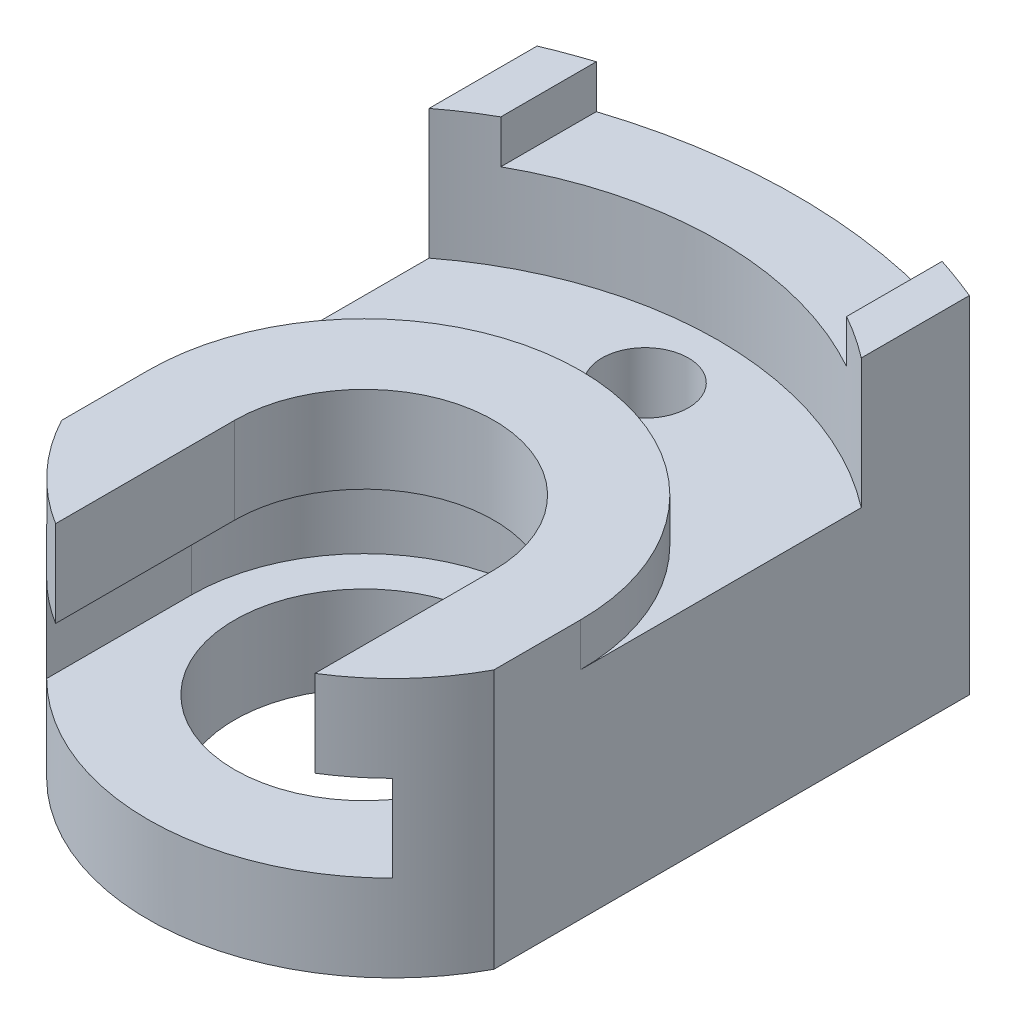
ISO-10303-21;
HEADER;
FILE_DESCRIPTION(('STEP AP214'),'2;1');
FILE_NAME('part.step','',(''),(''),'','','');
FILE_SCHEMA(('AUTOMOTIVE_DESIGN { 1 0 10303 214 1 1 1 1 }'));
ENDSEC;
DATA;
#1=APPLICATION_CONTEXT('core data for automotive mechanical design processes');
#2=APPLICATION_PROTOCOL_DEFINITION('international standard','automotive_design',2000,#1);
#3=PRODUCT_CONTEXT('',#1,'mechanical');
#4=PRODUCT('Part','Part','',(#3));
#5=PRODUCT_RELATED_PRODUCT_CATEGORY('part','',(#4));
#6=PRODUCT_DEFINITION_FORMATION('','',#4);
#7=PRODUCT_DEFINITION_CONTEXT('part definition',#1,'design');
#8=PRODUCT_DEFINITION('design','',#6,#7);
#9=PRODUCT_DEFINITION_SHAPE('','',#8);
#10=(LENGTH_UNIT() NAMED_UNIT(*) SI_UNIT(.MILLI.,.METRE.));
#11=(NAMED_UNIT(*) PLANE_ANGLE_UNIT() SI_UNIT($,.RADIAN.));
#12=(NAMED_UNIT(*) SI_UNIT($,.STERADIAN.) SOLID_ANGLE_UNIT());
#13=UNCERTAINTY_MEASURE_WITH_UNIT(LENGTH_MEASURE(1.E-05),#10,'distance_accuracy_value','');
#14=(GEOMETRIC_REPRESENTATION_CONTEXT(3) GLOBAL_UNCERTAINTY_ASSIGNED_CONTEXT((#13)) GLOBAL_UNIT_ASSIGNED_CONTEXT((#10,
#11,#12)) REPRESENTATION_CONTEXT('',''));
#15=CARTESIAN_POINT('',(0.,0.,0.));
#16=DIRECTION('',(0.,0.,1.));
#17=DIRECTION('',(1.,0.,0.));
#18=AXIS2_PLACEMENT_3D('',#15,#16,#17);
#19=CARTESIAN_POINT('',(0.,-11.,-4.));
#20=DIRECTION('',(0.,1.,0.));
#21=DIRECTION('',(0.,0.,1.));
#22=AXIS2_PLACEMENT_3D('',#19,#20,#21);
#23=CYLINDRICAL_SURFACE('',#22,0.5);
#24=CARTESIAN_POINT('',(0.,-4.,-4.));
#25=DIRECTION('',(0.,1.,0.));
#26=DIRECTION('',(0.,0.,1.));
#27=AXIS2_PLACEMENT_3D('',#24,#25,#26);
#28=CIRCLE('',#27,0.5);
#29=CARTESIAN_POINT('',(0.,-4.,-3.5));
#30=VERTEX_POINT('',#29);
#31=EDGE_CURVE('E345',#30,#30,#28,.T.);
#32=ORIENTED_EDGE('',*,*,#31,.F.);
#33=EDGE_LOOP('',(#32));
#34=FACE_BOUND('',#33,.T.);
#35=CARTESIAN_POINT('',(0.,-0.999999999999999,-4.));
#36=DIRECTION('',(0.,1.,0.));
#37=DIRECTION('',(0.,0.,1.));
#38=AXIS2_PLACEMENT_3D('',#35,#36,#37);
#39=CIRCLE('',#38,0.5);
#40=CARTESIAN_POINT('',(0.,-0.999999999999999,-3.5));
#41=VERTEX_POINT('',#40);
#42=EDGE_CURVE('E99',#41,#41,#39,.F.);
#43=ORIENTED_EDGE('',*,*,#42,.F.);
#44=EDGE_LOOP('',(#43));
#45=FACE_BOUND('',#44,.T.);
#46=ADVANCED_FACE('F95',(#34,#45),#23,.F.);
#47=CARTESIAN_POINT('',(5.,0.,7.5));
#48=DIRECTION('',(-1.,0.,0.));
#49=DIRECTION('',(0.,0.,1.));
#50=AXIS2_PLACEMENT_3D('',#47,#48,#49);
#51=PLANE('',#50);
#52=DIRECTION('',(0.,1.,0.));
#53=VECTOR('',#52,1.);
#54=CARTESIAN_POINT('',(5.,1.,2.5));
#55=LINE('',#54,#53);
#56=CARTESIAN_POINT('',(5.,1.,2.5));
#57=VERTEX_POINT('',#56);
#58=CARTESIAN_POINT('',(5.,2.,2.5));
#59=VERTEX_POINT('',#58);
#60=EDGE_CURVE('E232',#57,#59,#55,.T.);
#61=ORIENTED_EDGE('',*,*,#60,.T.);
#62=DIRECTION('',(0.,0.,-1.));
#63=VECTOR('',#62,1.);
#64=CARTESIAN_POINT('',(5.,2.,2.5));
#65=LINE('',#64,#63);
#66=CARTESIAN_POINT('',(5.,2.,4.5));
#67=VERTEX_POINT('',#66);
#68=EDGE_CURVE('E279',#67,#59,#65,.T.);
#69=ORIENTED_EDGE('',*,*,#68,.F.);
#70=DIRECTION('',(0.,1.,0.));
#71=VECTOR('',#70,1.);
#72=CARTESIAN_POINT('',(5.,-11.,4.5));
#73=LINE('',#72,#71);
#74=CARTESIAN_POINT('',(5.,-4.,4.5));
#75=VERTEX_POINT('',#74);
#76=EDGE_CURVE('E333',#75,#67,#73,.T.);
#77=ORIENTED_EDGE('',*,*,#76,.F.);
#78=DIRECTION('',(0.,0.,-1.));
#79=VECTOR('',#78,1.);
#80=CARTESIAN_POINT('',(5.,-4.,7.5));
#81=LINE('',#80,#79);
#82=CARTESIAN_POINT('',(5.,-4.,-6.5));
#83=VERTEX_POINT('',#82);
#84=EDGE_CURVE('E369',#75,#83,#81,.T.);
#85=ORIENTED_EDGE('',*,*,#84,.T.);
#86=DIRECTION('',(0.,1.,0.));
#87=VECTOR('',#86,1.);
#88=CARTESIAN_POINT('',(5.,-11.,-6.5));
#89=LINE('',#88,#87);
#90=CARTESIAN_POINT('',(5.,4.,-6.5));
#91=VERTEX_POINT('',#90);
#92=EDGE_CURVE('E349',#83,#91,#89,.T.);
#93=ORIENTED_EDGE('',*,*,#92,.T.);
#94=DIRECTION('',(0.,0.,-1.));
#95=VECTOR('',#94,1.);
#96=CARTESIAN_POINT('',(5.,4.,7.5));
#97=LINE('',#96,#95);
#98=CARTESIAN_POINT('',(5.,4.,-4.));
#99=VERTEX_POINT('',#98);
#100=EDGE_CURVE('E367',#99,#91,#97,.T.);
#101=ORIENTED_EDGE('',*,*,#100,.F.);
#102=DIRECTION('',(0.,1.,0.));
#103=VECTOR('',#102,1.);
#104=CARTESIAN_POINT('',(5.,1.,-4.));
#105=LINE('',#104,#103);
#106=CARTESIAN_POINT('',(5.,1.,-4.));
#107=VERTEX_POINT('',#106);
#108=EDGE_CURVE('E243',#107,#99,#105,.T.);
#109=ORIENTED_EDGE('',*,*,#108,.F.);
#110=DIRECTION('',(0.,0.,-1.));
#111=VECTOR('',#110,1.);
#112=CARTESIAN_POINT('',(5.,1.,2.5));
#113=LINE('',#112,#111);
#114=EDGE_CURVE('E250',#57,#107,#113,.T.);
#115=ORIENTED_EDGE('',*,*,#114,.F.);
#116=EDGE_LOOP('',(#61,#69,#77,#85,#93,#101,#109,#115));
#117=FACE_BOUND('',#116,.T.);
#118=ADVANCED_FACE('F256',(#117),#51,.F.);
#119=CARTESIAN_POINT('',(-5.,0.,7.5));
#120=DIRECTION('',(-1.,0.,0.));
#121=DIRECTION('',(0.,0.,1.));
#122=AXIS2_PLACEMENT_3D('',#119,#120,#121);
#123=PLANE('',#122);
#124=DIRECTION('',(0.,0.,1.));
#125=VECTOR('',#124,1.);
#126=CARTESIAN_POINT('',(-5.,2.,2.5));
#127=LINE('',#126,#125);
#128=CARTESIAN_POINT('',(-5.,2.,2.5));
#129=VERTEX_POINT('',#128);
#130=CARTESIAN_POINT('',(-5.,2.,4.49999999999999));
#131=VERTEX_POINT('',#130);
#132=EDGE_CURVE('E277',#129,#131,#127,.T.);
#133=ORIENTED_EDGE('',*,*,#132,.F.);
#134=DIRECTION('',(0.,1.,0.));
#135=VECTOR('',#134,1.);
#136=CARTESIAN_POINT('',(-5.,1.,2.5));
#137=LINE('',#136,#135);
#138=CARTESIAN_POINT('',(-5.,1.,2.5));
#139=VERTEX_POINT('',#138);
#140=EDGE_CURVE('E266',#139,#129,#137,.T.);
#141=ORIENTED_EDGE('',*,*,#140,.F.);
#142=DIRECTION('',(0.,0.,1.));
#143=VECTOR('',#142,1.);
#144=CARTESIAN_POINT('',(-5.,1.,2.5));
#145=LINE('',#144,#143);
#146=CARTESIAN_POINT('',(-5.,1.,-4.));
#147=VERTEX_POINT('',#146);
#148=EDGE_CURVE('E244',#147,#139,#145,.T.);
#149=ORIENTED_EDGE('',*,*,#148,.F.);
#150=DIRECTION('',(0.,1.,0.));
#151=VECTOR('',#150,1.);
#152=CARTESIAN_POINT('',(-5.,1.,-4.));
#153=LINE('',#152,#151);
#154=CARTESIAN_POINT('',(-5.,4.,-4.));
#155=VERTEX_POINT('',#154);
#156=EDGE_CURVE('E269',#147,#155,#153,.T.);
#157=ORIENTED_EDGE('',*,*,#156,.T.);
#158=DIRECTION('',(0.,0.,-1.));
#159=VECTOR('',#158,1.);
#160=CARTESIAN_POINT('',(-5.,4.,7.5));
#161=LINE('',#160,#159);
#162=CARTESIAN_POINT('',(-5.,4.,-6.5));
#163=VERTEX_POINT('',#162);
#164=EDGE_CURVE('E374',#155,#163,#161,.T.);
#165=ORIENTED_EDGE('',*,*,#164,.T.);
#166=DIRECTION('',(0.,1.,0.));
#167=VECTOR('',#166,1.);
#168=CARTESIAN_POINT('',(-5.,-11.,-6.5));
#169=LINE('',#168,#167);
#170=CARTESIAN_POINT('',(-5.,-4.,-6.5));
#171=VERTEX_POINT('',#170);
#172=EDGE_CURVE('E334',#171,#163,#169,.T.);
#173=ORIENTED_EDGE('',*,*,#172,.F.);
#174=DIRECTION('',(0.,0.,-1.));
#175=VECTOR('',#174,1.);
#176=CARTESIAN_POINT('',(-5.,-4.,7.5));
#177=LINE('',#176,#175);
#178=CARTESIAN_POINT('',(-5.,-4.,4.5));
#179=VERTEX_POINT('',#178);
#180=EDGE_CURVE('E371',#179,#171,#177,.T.);
#181=ORIENTED_EDGE('',*,*,#180,.F.);
#182=DIRECTION('',(0.,1.,0.));
#183=VECTOR('',#182,1.);
#184=CARTESIAN_POINT('',(-5.,-11.,4.5));
#185=LINE('',#184,#183);
#186=EDGE_CURVE('E118',#179,#131,#185,.T.);
#187=ORIENTED_EDGE('',*,*,#186,.T.);
#188=EDGE_LOOP('',(#133,#141,#149,#157,#165,#173,#181,#187));
#189=FACE_BOUND('',#188,.T.);
#190=ADVANCED_FACE('F439',(#189),#123,.T.);
#191=CARTESIAN_POINT('',(0.,-11.,2.5));
#192=DIRECTION('',(0.,1.,0.));
#193=DIRECTION('',(0.,0.,1.));
#194=AXIS2_PLACEMENT_3D('',#191,#192,#193);
#195=CYLINDRICAL_SURFACE('',#194,3.);
#196=CARTESIAN_POINT('',(0.,2.,2.5));
#197=DIRECTION('',(0.,1.,0.));
#198=DIRECTION('',(0.,0.,1.));
#199=AXIS2_PLACEMENT_3D('',#196,#197,#198);
#200=CIRCLE('',#199,3.);
#201=CARTESIAN_POINT('',(-3.,2.,2.5));
#202=VERTEX_POINT('',#201);
#203=CARTESIAN_POINT('',(3.,2.,2.5));
#204=VERTEX_POINT('',#203);
#205=EDGE_CURVE('E282',#202,#204,#200,.F.);
#206=ORIENTED_EDGE('',*,*,#205,.F.);
#207=DIRECTION('',(0.,1.,0.));
#208=VECTOR('',#207,1.);
#209=CARTESIAN_POINT('',(-3.,0.,2.5));
#210=LINE('',#209,#208);
#211=CARTESIAN_POINT('',(-3.,0.,2.5));
#212=VERTEX_POINT('',#211);
#213=EDGE_CURVE('E322',#212,#202,#210,.T.);
#214=ORIENTED_EDGE('',*,*,#213,.F.);
#215=CARTESIAN_POINT('',(0.,0.,2.5));
#216=DIRECTION('',(0.,1.,0.));
#217=DIRECTION('',(0.,0.,1.));
#218=AXIS2_PLACEMENT_3D('',#215,#216,#217);
#219=CIRCLE('',#218,3.);
#220=CARTESIAN_POINT('',(3.,0.,2.5));
#221=VERTEX_POINT('',#220);
#222=EDGE_CURVE('E312',#212,#221,#219,.F.);
#223=ORIENTED_EDGE('',*,*,#222,.T.);
#224=DIRECTION('',(0.,1.,0.));
#225=VECTOR('',#224,1.);
#226=CARTESIAN_POINT('',(3.,0.,2.5));
#227=LINE('',#226,#225);
#228=EDGE_CURVE('E323',#221,#204,#227,.T.);
#229=ORIENTED_EDGE('',*,*,#228,.T.);
#230=EDGE_LOOP('',(#206,#214,#223,#229));
#231=FACE_BOUND('',#230,.T.);
#232=ADVANCED_FACE('F400',(#231),#195,.F.);
#233=CARTESIAN_POINT('',(0.,-11.,1.83333333333333));
#234=DIRECTION('',(0.,1.,0.));
#235=DIRECTION('',(0.,0.,1.));
#236=AXIS2_PLACEMENT_3D('',#233,#234,#235);
#237=CYLINDRICAL_SURFACE('',#236,5.66666666666667);
#238=DIRECTION('',(0.,1.,0.));
#239=VECTOR('',#238,1.);
#240=CARTESIAN_POINT('',(-3.,-11.,6.64073503395198));
#241=LINE('',#240,#239);
#242=CARTESIAN_POINT('',(-3.,2.,6.64073503395198));
#243=VERTEX_POINT('',#242);
#244=CARTESIAN_POINT('',(-3.,0.,6.64073503395198));
#245=VERTEX_POINT('',#244);
#246=EDGE_CURVE('E326',#243,#245,#241,.F.);
#247=ORIENTED_EDGE('',*,*,#246,.F.);
#248=CARTESIAN_POINT('',(0.,2.,1.83333333333333));
#249=DIRECTION('',(0.,1.,0.));
#250=DIRECTION('',(0.,0.,1.));
#251=AXIS2_PLACEMENT_3D('',#248,#249,#250);
#252=CIRCLE('',#251,5.66666666666667);
#253=EDGE_CURVE('E111',#243,#131,#252,.F.);
#254=ORIENTED_EDGE('',*,*,#253,.T.);
#255=ORIENTED_EDGE('',*,*,#186,.F.);
#256=CARTESIAN_POINT('',(0.,-4.,1.83333333333333));
#257=DIRECTION('',(0.,1.,0.));
#258=DIRECTION('',(0.,0.,1.));
#259=AXIS2_PLACEMENT_3D('',#256,#257,#258);
#260=CIRCLE('',#259,5.66666666666667);
#261=EDGE_CURVE('E362',#179,#75,#260,.T.);
#262=ORIENTED_EDGE('',*,*,#261,.T.);
#263=ORIENTED_EDGE('',*,*,#76,.T.);
#264=CARTESIAN_POINT('',(3.,2.,6.64073503395199));
#265=VERTEX_POINT('',#264);
#266=EDGE_CURVE('E283',#67,#265,#252,.F.);
#267=ORIENTED_EDGE('',*,*,#266,.T.);
#268=DIRECTION('',(0.,1.,0.));
#269=VECTOR('',#268,1.);
#270=CARTESIAN_POINT('',(3.,-11.,6.64073503395199));
#271=LINE('',#270,#269);
#272=CARTESIAN_POINT('',(3.,0.,6.64073503395198));
#273=VERTEX_POINT('',#272);
#274=EDGE_CURVE('E330',#273,#265,#271,.T.);
#275=ORIENTED_EDGE('',*,*,#274,.F.);
#276=CARTESIAN_POINT('',(0.,0.,1.83333333333333));
#277=DIRECTION('',(0.,1.,0.));
#278=DIRECTION('',(0.,0.,1.));
#279=AXIS2_PLACEMENT_3D('',#276,#277,#278);
#280=CIRCLE('',#279,5.66666666666667);
#281=CARTESIAN_POINT('',(4.,0.,5.84719819293076));
#282=VERTEX_POINT('',#281);
#283=EDGE_CURVE('E307',#282,#273,#280,.F.);
#284=ORIENTED_EDGE('',*,*,#283,.F.);
#285=DIRECTION('',(0.,1.,0.));
#286=VECTOR('',#285,1.);
#287=CARTESIAN_POINT('',(4.,-11.,5.84719819293076));
#288=LINE('',#287,#286);
#289=CARTESIAN_POINT('',(4.,-2.,5.84719819293076));
#290=VERTEX_POINT('',#289);
#291=EDGE_CURVE('E382',#290,#282,#288,.T.);
#292=ORIENTED_EDGE('',*,*,#291,.F.);
#293=CARTESIAN_POINT('',(0.,-2.,1.83333333333333));
#294=DIRECTION('',(0.,1.,0.));
#295=DIRECTION('',(0.,0.,1.));
#296=AXIS2_PLACEMENT_3D('',#293,#294,#295);
#297=CIRCLE('',#296,5.66666666666667);
#298=CARTESIAN_POINT('',(-4.,-2.,5.84719819293076));
#299=VERTEX_POINT('',#298);
#300=EDGE_CURVE('E388',#290,#299,#297,.F.);
#301=ORIENTED_EDGE('',*,*,#300,.T.);
#302=DIRECTION('',(0.,1.,0.));
#303=VECTOR('',#302,1.);
#304=CARTESIAN_POINT('',(-4.,-11.,5.84719819293076));
#305=LINE('',#304,#303);
#306=CARTESIAN_POINT('',(-4.,0.,5.84719819293076));
#307=VERTEX_POINT('',#306);
#308=EDGE_CURVE('E391',#307,#299,#305,.F.);
#309=ORIENTED_EDGE('',*,*,#308,.F.);
#310=EDGE_CURVE('E309',#245,#307,#280,.F.);
#311=ORIENTED_EDGE('',*,*,#310,.F.);
#312=EDGE_LOOP('',(#247,#254,#255,#262,#263,#267,#275,#284,#292,#301,#309,#311));
#313=FACE_BOUND('',#312,.T.);
#314=ADVANCED_FACE('F409',(#313),#237,.T.);
#315=CARTESIAN_POINT('',(3.,0.,2.5));
#316=DIRECTION('',(1.,0.,0.));
#317=DIRECTION('',(0.,0.,-1.));
#318=AXIS2_PLACEMENT_3D('',#315,#316,#317);
#319=PLANE('',#318);
#320=DIRECTION('',(0.,0.,1.));
#321=VECTOR('',#320,1.);
#322=CARTESIAN_POINT('',(3.,2.,2.5));
#323=LINE('',#322,#321);
#324=EDGE_CURVE('E285',#204,#265,#323,.T.);
#325=ORIENTED_EDGE('',*,*,#324,.F.);
#326=ORIENTED_EDGE('',*,*,#228,.F.);
#327=DIRECTION('',(0.,0.,-1.));
#328=VECTOR('',#327,1.);
#329=CARTESIAN_POINT('',(3.,0.,2.5));
#330=LINE('',#329,#328);
#331=EDGE_CURVE('E320',#273,#221,#330,.T.);
#332=ORIENTED_EDGE('',*,*,#331,.F.);
#333=ORIENTED_EDGE('',*,*,#274,.T.);
#334=EDGE_LOOP('',(#325,#326,#332,#333));
#335=FACE_BOUND('',#334,.T.);
#336=ADVANCED_FACE('F430',(#335),#319,.F.);
#337=CARTESIAN_POINT('',(-3.,0.,2.5));
#338=DIRECTION('',(-1.,0.,0.));
#339=DIRECTION('',(0.,0.,1.));
#340=AXIS2_PLACEMENT_3D('',#337,#338,#339);
#341=PLANE('',#340);
#342=DIRECTION('',(0.,0.,-1.));
#343=VECTOR('',#342,1.);
#344=CARTESIAN_POINT('',(-3.,2.,2.5));
#345=LINE('',#344,#343);
#346=EDGE_CURVE('E104',#243,#202,#345,.T.);
#347=ORIENTED_EDGE('',*,*,#346,.F.);
#348=ORIENTED_EDGE('',*,*,#246,.T.);
#349=DIRECTION('',(0.,0.,1.));
#350=VECTOR('',#349,1.);
#351=CARTESIAN_POINT('',(-3.,0.,2.5));
#352=LINE('',#351,#350);
#353=EDGE_CURVE('E317',#212,#245,#352,.T.);
#354=ORIENTED_EDGE('',*,*,#353,.F.);
#355=ORIENTED_EDGE('',*,*,#213,.T.);
#356=EDGE_LOOP('',(#347,#348,#354,#355));
#357=FACE_BOUND('',#356,.T.);
#358=ADVANCED_FACE('F403',(#357),#341,.F.);
#359=CARTESIAN_POINT('',(0.,-4.,2.5));
#360=DIRECTION('',(0.,1.,0.));
#361=DIRECTION('',(0.,0.,1.));
#362=AXIS2_PLACEMENT_3D('',#359,#360,#361);
#363=CIRCLE('',#362,3.);
#364=CARTESIAN_POINT('',(0.,-4.,5.5));
#365=VERTEX_POINT('',#364);
#366=EDGE_CURVE('E364',#365,#365,#363,.T.);
#367=ORIENTED_EDGE('',*,*,#366,.F.);
#368=EDGE_LOOP('',(#367));
#369=FACE_BOUND('',#368,.T.);
#370=CARTESIAN_POINT('',(0.,-2.,2.5));
#371=DIRECTION('',(0.,1.,0.));
#372=DIRECTION('',(0.,0.,1.));
#373=AXIS2_PLACEMENT_3D('',#370,#371,#372);
#374=CIRCLE('',#373,3.);
#375=CARTESIAN_POINT('',(0.,-2.,5.5));
#376=VERTEX_POINT('',#375);
#377=EDGE_CURVE('E311',#376,#376,#374,.F.);
#378=ORIENTED_EDGE('',*,*,#377,.F.);
#379=EDGE_LOOP('',(#378));
#380=FACE_BOUND('',#379,.T.);
#381=ADVANCED_FACE('F507',(#369,#380),#195,.F.);
#382=CARTESIAN_POINT('',(0.,3.,7.5));
#383=DIRECTION('',(0.,1.,0.));
#384=DIRECTION('',(0.,0.,1.));
#385=AXIS2_PLACEMENT_3D('',#382,#383,#384);
#386=PLANE('',#385);
#387=CARTESIAN_POINT('',(0.,3.,2.5));
#388=DIRECTION('',(0.,1.,0.));
#389=DIRECTION('',(0.,0.,1.));
#390=AXIS2_PLACEMENT_3D('',#387,#388,#389);
#391=CIRCLE('',#390,8.20060973342836);
#392=CARTESIAN_POINT('',(4.,3.,-4.65891053163817));
#393=VERTEX_POINT('',#392);
#394=CARTESIAN_POINT('',(-4.,3.,-4.65891053163817));
#395=VERTEX_POINT('',#394);
#396=EDGE_CURVE('E268',#393,#395,#391,.T.);
#397=ORIENTED_EDGE('',*,*,#396,.F.);
#398=DIRECTION('',(0.,0.,-1.));
#399=VECTOR('',#398,1.);
#400=CARTESIAN_POINT('',(4.,3.,7.5));
#401=LINE('',#400,#399);
#402=CARTESIAN_POINT('',(4.,3.,-6.86931687685298));
#403=VERTEX_POINT('',#402);
#404=EDGE_CURVE('E380',#393,#403,#401,.T.);
#405=ORIENTED_EDGE('',*,*,#404,.T.);
#406=CARTESIAN_POINT('',(0.,3.,5.5));
#407=DIRECTION('',(0.,1.,0.));
#408=DIRECTION('',(0.,0.,1.));
#409=AXIS2_PLACEMENT_3D('',#406,#407,#408);
#410=CIRCLE('',#409,13.);
#411=CARTESIAN_POINT('',(-4.,3.,-6.86931687685298));
#412=VERTEX_POINT('',#411);
#413=EDGE_CURVE('E356',#412,#403,#410,.F.);
#414=ORIENTED_EDGE('',*,*,#413,.F.);
#415=DIRECTION('',(0.,0.,-1.));
#416=VECTOR('',#415,1.);
#417=CARTESIAN_POINT('',(-4.,3.,7.5));
#418=LINE('',#417,#416);
#419=EDGE_CURVE('E378',#395,#412,#418,.T.);
#420=ORIENTED_EDGE('',*,*,#419,.F.);
#421=EDGE_LOOP('',(#397,#405,#414,#420));
#422=FACE_BOUND('',#421,.T.);
#423=ADVANCED_FACE('F511',(#422),#386,.T.);
#424=CARTESIAN_POINT('',(0.,4.,7.5));
#425=DIRECTION('',(0.,1.,0.));
#426=DIRECTION('',(0.,0.,1.));
#427=AXIS2_PLACEMENT_3D('',#424,#425,#426);
#428=PLANE('',#427);
#429=CARTESIAN_POINT('',(0.,4.,2.5));
#430=DIRECTION('',(0.,1.,0.));
#431=DIRECTION('',(0.,0.,-1.));
#432=AXIS2_PLACEMENT_3D('',#429,#430,#431);
#433=CIRCLE('',#432,8.20060973342836);
#434=CARTESIAN_POINT('',(-4.,4.,-4.65891053163817));
#435=VERTEX_POINT('',#434);
#436=EDGE_CURVE('E265',#435,#155,#433,.T.);
#437=ORIENTED_EDGE('',*,*,#436,.F.);
#438=DIRECTION('',(0.,0.,-1.));
#439=VECTOR('',#438,1.);
#440=CARTESIAN_POINT('',(-4.,4.,7.5));
#441=LINE('',#440,#439);
#442=CARTESIAN_POINT('',(-4.,4.,-6.86931687685298));
#443=VERTEX_POINT('',#442);
#444=EDGE_CURVE('E376',#435,#443,#441,.T.);
#445=ORIENTED_EDGE('',*,*,#444,.T.);
#446=CARTESIAN_POINT('',(0.,4.,5.5));
#447=DIRECTION('',(0.,1.,0.));
#448=DIRECTION('',(0.,0.,1.));
#449=AXIS2_PLACEMENT_3D('',#446,#447,#448);
#450=CIRCLE('',#449,13.);
#451=EDGE_CURVE('E337',#163,#443,#450,.F.);
#452=ORIENTED_EDGE('',*,*,#451,.F.);
#453=ORIENTED_EDGE('',*,*,#164,.F.);
#454=EDGE_LOOP('',(#437,#445,#452,#453));
#455=FACE_BOUND('',#454,.T.);
#456=ADVANCED_FACE('F448',(#455),#428,.T.);
#457=CARTESIAN_POINT('',(0.,-4.,7.5));
#458=DIRECTION('',(0.,1.,0.));
#459=DIRECTION('',(0.,0.,1.));
#460=AXIS2_PLACEMENT_3D('',#457,#458,#459);
#461=PLANE('',#460);
#462=ORIENTED_EDGE('',*,*,#31,.T.);
#463=EDGE_LOOP('',(#462));
#464=FACE_BOUND('',#463,.T.);
#465=ORIENTED_EDGE('',*,*,#366,.T.);
#466=EDGE_LOOP('',(#465));
#467=FACE_BOUND('',#466,.T.);
#468=ORIENTED_EDGE('',*,*,#180,.T.);
#469=CARTESIAN_POINT('',(0.,-4.,5.5));
#470=DIRECTION('',(0.,1.,0.));
#471=DIRECTION('',(0.,0.,1.));
#472=AXIS2_PLACEMENT_3D('',#469,#470,#471);
#473=CIRCLE('',#472,13.);
#474=EDGE_CURVE('E352',#171,#83,#473,.F.);
#475=ORIENTED_EDGE('',*,*,#474,.T.);
#476=ORIENTED_EDGE('',*,*,#84,.F.);
#477=ORIENTED_EDGE('',*,*,#261,.F.);
#478=EDGE_LOOP('',(#468,#475,#476,#477));
#479=FACE_BOUND('',#478,.T.);
#480=ADVANCED_FACE('F435',(#464,#467,#479),#461,.F.);
#481=CARTESIAN_POINT('',(4.,4.,-4.65891053163817));
#482=VERTEX_POINT('',#481);
#483=EDGE_CURVE('E254',#99,#482,#433,.T.);
#484=ORIENTED_EDGE('',*,*,#483,.F.);
#485=ORIENTED_EDGE('',*,*,#100,.T.);
#486=CARTESIAN_POINT('',(0.,4.,5.5));
#487=DIRECTION('',(0.,1.,0.));
#488=DIRECTION('',(0.,0.,1.));
#489=AXIS2_PLACEMENT_3D('',#486,#487,#488);
#490=CIRCLE('',#489,13.);
#491=CARTESIAN_POINT('',(4.,4.,-6.86931687685298));
#492=VERTEX_POINT('',#491);
#493=EDGE_CURVE('E346',#492,#91,#490,.F.);
#494=ORIENTED_EDGE('',*,*,#493,.F.);
#495=DIRECTION('',(0.,0.,-1.));
#496=VECTOR('',#495,1.);
#497=CARTESIAN_POINT('',(4.,4.,7.5));
#498=LINE('',#497,#496);
#499=EDGE_CURVE('E365',#482,#492,#498,.T.);
#500=ORIENTED_EDGE('',*,*,#499,.F.);
#501=EDGE_LOOP('',(#484,#485,#494,#500));
#502=FACE_BOUND('',#501,.T.);
#503=ADVANCED_FACE('F463',(#502),#428,.T.);
#504=CARTESIAN_POINT('',(4.,0.,7.5));
#505=DIRECTION('',(-1.,0.,0.));
#506=DIRECTION('',(0.,0.,1.));
#507=AXIS2_PLACEMENT_3D('',#504,#505,#506);
#508=PLANE('',#507);
#509=DIRECTION('',(0.,1.,0.));
#510=VECTOR('',#509,1.);
#511=CARTESIAN_POINT('',(4.,1.,-4.65891053163817));
#512=LINE('',#511,#510);
#513=EDGE_CURVE('E274',#482,#393,#512,.F.);
#514=ORIENTED_EDGE('',*,*,#513,.F.);
#515=ORIENTED_EDGE('',*,*,#499,.T.);
#516=DIRECTION('',(0.,1.,0.));
#517=VECTOR('',#516,1.);
#518=CARTESIAN_POINT('',(4.,-11.,-6.86931687685298));
#519=LINE('',#518,#517);
#520=EDGE_CURVE('E359',#403,#492,#519,.T.);
#521=ORIENTED_EDGE('',*,*,#520,.F.);
#522=ORIENTED_EDGE('',*,*,#404,.F.);
#523=EDGE_LOOP('',(#514,#515,#521,#522));
#524=FACE_BOUND('',#523,.T.);
#525=ADVANCED_FACE('F97',(#524),#508,.T.);
#526=CARTESIAN_POINT('',(-4.,0.,7.5));
#527=DIRECTION('',(-1.,0.,0.));
#528=DIRECTION('',(0.,0.,1.));
#529=AXIS2_PLACEMENT_3D('',#526,#527,#528);
#530=PLANE('',#529);
#531=ORIENTED_EDGE('',*,*,#444,.F.);
#532=DIRECTION('',(0.,1.,0.));
#533=VECTOR('',#532,1.);
#534=CARTESIAN_POINT('',(-4.,1.,-4.65891053163817));
#535=LINE('',#534,#533);
#536=EDGE_CURVE('E12',#435,#395,#535,.F.);
#537=ORIENTED_EDGE('',*,*,#536,.T.);
#538=ORIENTED_EDGE('',*,*,#419,.T.);
#539=DIRECTION('',(0.,1.,0.));
#540=VECTOR('',#539,1.);
#541=CARTESIAN_POINT('',(-4.,-11.,-6.86931687685298));
#542=LINE('',#541,#540);
#543=EDGE_CURVE('E340',#412,#443,#542,.T.);
#544=ORIENTED_EDGE('',*,*,#543,.T.);
#545=EDGE_LOOP('',(#531,#537,#538,#544));
#546=FACE_BOUND('',#545,.T.);
#547=ADVANCED_FACE('F451',(#546),#530,.F.);
#548=CARTESIAN_POINT('',(0.,-11.,5.5));
#549=DIRECTION('',(0.,1.,0.));
#550=DIRECTION('',(0.,0.,1.));
#551=AXIS2_PLACEMENT_3D('',#548,#549,#550);
#552=CYLINDRICAL_SURFACE('',#551,13.);
#553=ORIENTED_EDGE('',*,*,#520,.T.);
#554=ORIENTED_EDGE('',*,*,#493,.T.);
#555=ORIENTED_EDGE('',*,*,#92,.F.);
#556=ORIENTED_EDGE('',*,*,#474,.F.);
#557=ORIENTED_EDGE('',*,*,#172,.T.);
#558=ORIENTED_EDGE('',*,*,#451,.T.);
#559=ORIENTED_EDGE('',*,*,#543,.F.);
#560=ORIENTED_EDGE('',*,*,#413,.T.);
#561=EDGE_LOOP('',(#553,#554,#555,#556,#557,#558,#559,#560));
#562=FACE_BOUND('',#561,.T.);
#563=ADVANCED_FACE('F443',(#562),#552,.T.);
#564=CARTESIAN_POINT('',(0.,-2.,2.5));
#565=DIRECTION('',(0.,1.,0.));
#566=DIRECTION('',(0.,0.,1.));
#567=AXIS2_PLACEMENT_3D('',#564,#565,#566);
#568=PLANE('',#567);
#569=DIRECTION('',(0.,0.,-1.));
#570=VECTOR('',#569,1.);
#571=CARTESIAN_POINT('',(4.,-2.,2.5));
#572=LINE('',#571,#570);
#573=CARTESIAN_POINT('',(4.,-2.,2.5));
#574=VERTEX_POINT('',#573);
#575=EDGE_CURVE('E294',#290,#574,#572,.T.);
#576=ORIENTED_EDGE('',*,*,#575,.T.);
#577=CARTESIAN_POINT('',(0.,-2.,2.5));
#578=DIRECTION('',(0.,1.,0.));
#579=DIRECTION('',(0.,0.,1.));
#580=AXIS2_PLACEMENT_3D('',#577,#578,#579);
#581=CIRCLE('',#580,4.);
#582=CARTESIAN_POINT('',(-4.,-2.,2.5));
#583=VERTEX_POINT('',#582);
#584=EDGE_CURVE('E287',#574,#583,#581,.T.);
#585=ORIENTED_EDGE('',*,*,#584,.T.);
#586=DIRECTION('',(0.,0.,1.));
#587=VECTOR('',#586,1.);
#588=CARTESIAN_POINT('',(-4.,-2.,2.5));
#589=LINE('',#588,#587);
#590=EDGE_CURVE('E290',#583,#299,#589,.T.);
#591=ORIENTED_EDGE('',*,*,#590,.T.);
#592=ORIENTED_EDGE('',*,*,#300,.F.);
#593=EDGE_LOOP('',(#576,#585,#591,#592));
#594=FACE_BOUND('',#593,.T.);
#595=ORIENTED_EDGE('',*,*,#377,.T.);
#596=EDGE_LOOP('',(#595));
#597=FACE_BOUND('',#596,.T.);
#598=ADVANCED_FACE('F415',(#594,#597),#568,.T.);
#599=CARTESIAN_POINT('',(0.,0.,2.5));
#600=DIRECTION('',(0.,1.,0.));
#601=DIRECTION('',(0.,0.,1.));
#602=AXIS2_PLACEMENT_3D('',#599,#600,#601);
#603=PLANE('',#602);
#604=ORIENTED_EDGE('',*,*,#310,.T.);
#605=DIRECTION('',(0.,0.,1.));
#606=VECTOR('',#605,1.);
#607=CARTESIAN_POINT('',(-4.,0.,2.5));
#608=LINE('',#607,#606);
#609=CARTESIAN_POINT('',(-4.,0.,2.5));
#610=VERTEX_POINT('',#609);
#611=EDGE_CURVE('E300',#610,#307,#608,.T.);
#612=ORIENTED_EDGE('',*,*,#611,.F.);
#613=CARTESIAN_POINT('',(0.,0.,2.5));
#614=DIRECTION('',(0.,1.,0.));
#615=DIRECTION('',(0.,0.,1.));
#616=AXIS2_PLACEMENT_3D('',#613,#614,#615);
#617=CIRCLE('',#616,4.);
#618=CARTESIAN_POINT('',(4.,0.,2.5));
#619=VERTEX_POINT('',#618);
#620=EDGE_CURVE('E297',#619,#610,#617,.T.);
#621=ORIENTED_EDGE('',*,*,#620,.F.);
#622=DIRECTION('',(0.,0.,-1.));
#623=VECTOR('',#622,1.);
#624=CARTESIAN_POINT('',(4.,0.,2.5));
#625=LINE('',#624,#623);
#626=EDGE_CURVE('E291',#282,#619,#625,.T.);
#627=ORIENTED_EDGE('',*,*,#626,.F.);
#628=ORIENTED_EDGE('',*,*,#283,.T.);
#629=ORIENTED_EDGE('',*,*,#331,.T.);
#630=ORIENTED_EDGE('',*,*,#222,.F.);
#631=ORIENTED_EDGE('',*,*,#353,.T.);
#632=EDGE_LOOP('',(#604,#612,#621,#627,#628,#629,#630,#631));
#633=FACE_BOUND('',#632,.T.);
#634=ADVANCED_FACE('F406',(#633),#603,.F.);
#635=CARTESIAN_POINT('',(0.,-2.,2.5));
#636=DIRECTION('',(0.,1.,0.));
#637=DIRECTION('',(0.,0.,1.));
#638=AXIS2_PLACEMENT_3D('',#635,#636,#637);
#639=CYLINDRICAL_SURFACE('',#638,4.);
#640=ORIENTED_EDGE('',*,*,#620,.T.);
#641=DIRECTION('',(0.,1.,0.));
#642=VECTOR('',#641,1.);
#643=CARTESIAN_POINT('',(-4.,-2.,2.5));
#644=LINE('',#643,#642);
#645=EDGE_CURVE('E296',#583,#610,#644,.T.);
#646=ORIENTED_EDGE('',*,*,#645,.F.);
#647=ORIENTED_EDGE('',*,*,#584,.F.);
#648=DIRECTION('',(0.,1.,0.));
#649=VECTOR('',#648,1.);
#650=CARTESIAN_POINT('',(4.,-2.,2.5));
#651=LINE('',#650,#649);
#652=EDGE_CURVE('E304',#574,#619,#651,.T.);
#653=ORIENTED_EDGE('',*,*,#652,.T.);
#654=EDGE_LOOP('',(#640,#646,#647,#653));
#655=FACE_BOUND('',#654,.T.);
#656=ADVANCED_FACE('F421',(#655),#639,.F.);
#657=CARTESIAN_POINT('',(4.,-2.,2.5));
#658=DIRECTION('',(1.,0.,0.));
#659=DIRECTION('',(0.,0.,-1.));
#660=AXIS2_PLACEMENT_3D('',#657,#658,#659);
#661=PLANE('',#660);
#662=ORIENTED_EDGE('',*,*,#291,.T.);
#663=ORIENTED_EDGE('',*,*,#626,.T.);
#664=ORIENTED_EDGE('',*,*,#652,.F.);
#665=ORIENTED_EDGE('',*,*,#575,.F.);
#666=EDGE_LOOP('',(#662,#663,#664,#665));
#667=FACE_BOUND('',#666,.T.);
#668=ADVANCED_FACE('F537',(#667),#661,.F.);
#669=CARTESIAN_POINT('',(-4.,-2.,2.5));
#670=DIRECTION('',(-1.,0.,0.));
#671=DIRECTION('',(0.,0.,1.));
#672=AXIS2_PLACEMENT_3D('',#669,#670,#671);
#673=PLANE('',#672);
#674=ORIENTED_EDGE('',*,*,#308,.T.);
#675=ORIENTED_EDGE('',*,*,#590,.F.);
#676=ORIENTED_EDGE('',*,*,#645,.T.);
#677=ORIENTED_EDGE('',*,*,#611,.T.);
#678=EDGE_LOOP('',(#674,#675,#676,#677));
#679=FACE_BOUND('',#678,.T.);
#680=ADVANCED_FACE('F413',(#679),#673,.F.);
#681=CARTESIAN_POINT('',(0.,2.,2.5));
#682=DIRECTION('',(0.,1.,0.));
#683=DIRECTION('',(0.,0.,1.));
#684=AXIS2_PLACEMENT_3D('',#681,#682,#683);
#685=PLANE('',#684);
#686=ORIENTED_EDGE('',*,*,#68,.T.);
#687=CARTESIAN_POINT('',(0.,2.,2.5));
#688=DIRECTION('',(0.,1.,0.));
#689=DIRECTION('',(0.,0.,1.));
#690=AXIS2_PLACEMENT_3D('',#687,#688,#689);
#691=CIRCLE('',#690,5.);
#692=EDGE_CURVE('E238',#59,#129,#691,.T.);
#693=ORIENTED_EDGE('',*,*,#692,.T.);
#694=ORIENTED_EDGE('',*,*,#132,.T.);
#695=ORIENTED_EDGE('',*,*,#253,.F.);
#696=ORIENTED_EDGE('',*,*,#346,.T.);
#697=ORIENTED_EDGE('',*,*,#205,.T.);
#698=ORIENTED_EDGE('',*,*,#324,.T.);
#699=ORIENTED_EDGE('',*,*,#266,.F.);
#700=EDGE_LOOP('',(#686,#693,#694,#695,#696,#697,#698,#699));
#701=FACE_BOUND('',#700,.T.);
#702=ADVANCED_FACE('F394',(#701),#685,.T.);
#703=CARTESIAN_POINT('',(0.,1.,2.5));
#704=DIRECTION('',(0.,-1.,0.));
#705=DIRECTION('',(0.,0.,-1.));
#706=AXIS2_PLACEMENT_3D('',#703,#704,#705);
#707=PLANE('',#706);
#708=CARTESIAN_POINT('',(0.,1.,-4.));
#709=DIRECTION('',(0.,1.,0.));
#710=DIRECTION('',(0.,0.,1.));
#711=AXIS2_PLACEMENT_3D('',#708,#709,#710);
#712=CIRCLE('',#711,1.);
#713=CARTESIAN_POINT('',(0.,1.,-3.));
#714=VERTEX_POINT('',#713);
#715=EDGE_CURVE('E472',#714,#714,#712,.T.);
#716=ORIENTED_EDGE('',*,*,#715,.F.);
#717=EDGE_LOOP('',(#716));
#718=FACE_BOUND('',#717,.T.);
#719=CARTESIAN_POINT('',(0.,1.,2.5));
#720=DIRECTION('',(0.,-1.,0.));
#721=DIRECTION('',(0.,0.,-1.));
#722=AXIS2_PLACEMENT_3D('',#719,#720,#721);
#723=CIRCLE('',#722,5.);
#724=EDGE_CURVE('E235',#139,#57,#723,.T.);
#725=ORIENTED_EDGE('',*,*,#724,.T.);
#726=ORIENTED_EDGE('',*,*,#114,.T.);
#727=CARTESIAN_POINT('',(0.,1.,2.5));
#728=DIRECTION('',(0.,1.,0.));
#729=DIRECTION('',(0.,0.,-1.));
#730=AXIS2_PLACEMENT_3D('',#727,#728,#729);
#731=CIRCLE('',#730,8.20060973342836);
#732=EDGE_CURVE('E258',#107,#147,#731,.T.);
#733=ORIENTED_EDGE('',*,*,#732,.T.);
#734=ORIENTED_EDGE('',*,*,#148,.T.);
#735=EDGE_LOOP('',(#725,#726,#733,#734));
#736=FACE_BOUND('',#735,.T.);
#737=ADVANCED_FACE('F248',(#718,#736),#707,.F.);
#738=CARTESIAN_POINT('',(0.,1.,2.5));
#739=DIRECTION('',(0.,1.,0.));
#740=DIRECTION('',(0.,0.,1.));
#741=AXIS2_PLACEMENT_3D('',#738,#739,#740);
#742=CYLINDRICAL_SURFACE('',#741,5.);
#743=ORIENTED_EDGE('',*,*,#692,.F.);
#744=ORIENTED_EDGE('',*,*,#60,.F.);
#745=ORIENTED_EDGE('',*,*,#724,.F.);
#746=ORIENTED_EDGE('',*,*,#140,.T.);
#747=EDGE_LOOP('',(#743,#744,#745,#746));
#748=FACE_BOUND('',#747,.T.);
#749=ADVANCED_FACE('F234',(#748),#742,.T.);
#750=CARTESIAN_POINT('',(0.,1.,2.5));
#751=DIRECTION('',(0.,1.,0.));
#752=DIRECTION('',(0.,0.,1.));
#753=AXIS2_PLACEMENT_3D('',#750,#751,#752);
#754=CYLINDRICAL_SURFACE('',#753,8.20060973342836);
#755=ORIENTED_EDGE('',*,*,#513,.T.);
#756=ORIENTED_EDGE('',*,*,#396,.T.);
#757=ORIENTED_EDGE('',*,*,#536,.F.);
#758=ORIENTED_EDGE('',*,*,#436,.T.);
#759=ORIENTED_EDGE('',*,*,#156,.F.);
#760=ORIENTED_EDGE('',*,*,#732,.F.);
#761=ORIENTED_EDGE('',*,*,#108,.T.);
#762=ORIENTED_EDGE('',*,*,#483,.T.);
#763=EDGE_LOOP('',(#755,#756,#757,#758,#759,#760,#761,#762));
#764=FACE_BOUND('',#763,.T.);
#765=ADVANCED_FACE('F465',(#764),#754,.F.);
#766=CARTESIAN_POINT('',(0.,-0.999999999999999,-4.));
#767=DIRECTION('',(0.,1.,0.));
#768=DIRECTION('',(0.,0.,1.));
#769=AXIS2_PLACEMENT_3D('',#766,#767,#768);
#770=PLANE('',#769);
#771=CARTESIAN_POINT('',(0.,-0.999999999999999,-4.));
#772=DIRECTION('',(0.,1.,0.));
#773=DIRECTION('',(0.,0.,1.));
#774=AXIS2_PLACEMENT_3D('',#771,#772,#773);
#775=CIRCLE('',#774,1.);
#776=CARTESIAN_POINT('',(0.,-0.999999999999999,-3.));
#777=VERTEX_POINT('',#776);
#778=EDGE_CURVE('E468',#777,#777,#775,.T.);
#779=ORIENTED_EDGE('',*,*,#778,.T.);
#780=EDGE_LOOP('',(#779));
#781=FACE_BOUND('',#780,.T.);
#782=ORIENTED_EDGE('',*,*,#42,.T.);
#783=EDGE_LOOP('',(#782));
#784=FACE_BOUND('',#783,.T.);
#785=ADVANCED_FACE('F619',(#781,#784),#770,.T.);
#786=CARTESIAN_POINT('',(0.,-0.999999999999999,-4.));
#787=DIRECTION('',(0.,1.,0.));
#788=DIRECTION('',(0.,0.,1.));
#789=AXIS2_PLACEMENT_3D('',#786,#787,#788);
#790=CYLINDRICAL_SURFACE('',#789,1.);
#791=ORIENTED_EDGE('',*,*,#778,.F.);
#792=EDGE_LOOP('',(#791));
#793=FACE_BOUND('',#792,.T.);
#794=ORIENTED_EDGE('',*,*,#715,.T.);
#795=EDGE_LOOP('',(#794));
#796=FACE_BOUND('',#795,.T.);
#797=ADVANCED_FACE('F479',(#793,#796),#790,.F.);
#798=CLOSED_SHELL('',(#46,#118,#190,#232,#314,#336,#358,#381,#423,#456,#480,#503,#525,#547,#563,
#598,#634,#656,#668,#680,#702,#737,#749,#765,#785,#797));
#799=MANIFOLD_SOLID_BREP('B2',#798);
#800=ADVANCED_BREP_SHAPE_REPRESENTATION('',(#18,#799),#14);
#801=SHAPE_DEFINITION_REPRESENTATION(#9,#800);
ENDSEC;
END-ISO-10303-21;
